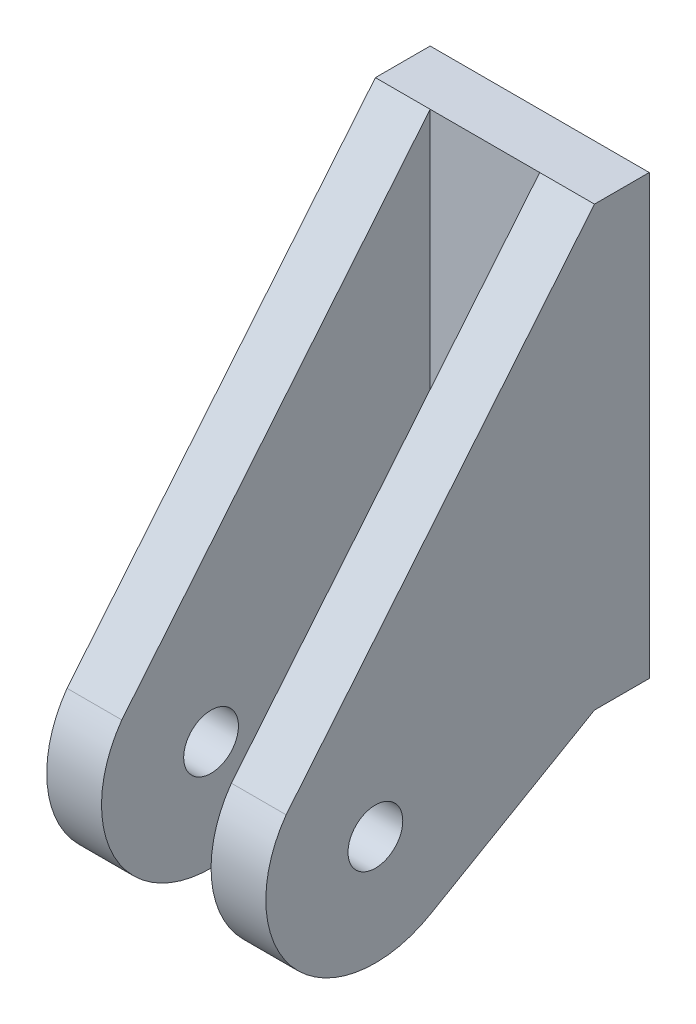
ISO-10303-21;
HEADER;
FILE_DESCRIPTION(('STEP AP214'),'2;1');
FILE_NAME('part.step','',(''),(''),'','','');
FILE_SCHEMA(('AUTOMOTIVE_DESIGN { 1 0 10303 214 1 1 1 1 }'));
ENDSEC;
DATA;
#1=APPLICATION_CONTEXT('core data for automotive mechanical design processes');
#2=APPLICATION_PROTOCOL_DEFINITION('international standard','automotive_design',2000,#1);
#3=PRODUCT_CONTEXT('',#1,'mechanical');
#4=PRODUCT('Part','Part','',(#3));
#5=PRODUCT_RELATED_PRODUCT_CATEGORY('part','',(#4));
#6=PRODUCT_DEFINITION_FORMATION('','',#4);
#7=PRODUCT_DEFINITION_CONTEXT('part definition',#1,'design');
#8=PRODUCT_DEFINITION('design','',#6,#7);
#9=PRODUCT_DEFINITION_SHAPE('','',#8);
#10=(LENGTH_UNIT() NAMED_UNIT(*) SI_UNIT(.MILLI.,.METRE.));
#11=(NAMED_UNIT(*) PLANE_ANGLE_UNIT() SI_UNIT($,.RADIAN.));
#12=(NAMED_UNIT(*) SI_UNIT($,.STERADIAN.) SOLID_ANGLE_UNIT());
#13=UNCERTAINTY_MEASURE_WITH_UNIT(LENGTH_MEASURE(1.E-05),#10,'distance_accuracy_value','');
#14=(GEOMETRIC_REPRESENTATION_CONTEXT(3) GLOBAL_UNCERTAINTY_ASSIGNED_CONTEXT((#13)) GLOBAL_UNIT_ASSIGNED_CONTEXT((#10,
#11,#12)) REPRESENTATION_CONTEXT('',''));
#15=CARTESIAN_POINT('',(0.,0.,0.));
#16=DIRECTION('',(0.,0.,1.));
#17=DIRECTION('',(1.,0.,0.));
#18=AXIS2_PLACEMENT_3D('',#15,#16,#17);
#19=CARTESIAN_POINT('',(0.,0.,6.35));
#20=DIRECTION('',(0.,0.,-1.));
#21=DIRECTION('',(-1.,0.,0.));
#22=AXIS2_PLACEMENT_3D('',#19,#20,#21);
#23=PLANE('',#22);
#24=DIRECTION('',(0.,1.,0.));
#25=VECTOR('',#24,1.);
#26=CARTESIAN_POINT('',(6.35,0.,6.35));
#27=LINE('',#26,#25);
#28=CARTESIAN_POINT('',(6.35,0.,6.35));
#29=VERTEX_POINT('',#28);
#30=CARTESIAN_POINT('',(6.35,50.8,6.35));
#31=VERTEX_POINT('',#30);
#32=EDGE_CURVE('E50',#29,#31,#27,.T.);
#33=ORIENTED_EDGE('',*,*,#32,.F.);
#34=DIRECTION('',(1.,0.,0.));
#35=VECTOR('',#34,1.);
#36=CARTESIAN_POINT('',(0.,0.,6.35));
#37=LINE('',#36,#35);
#38=CARTESIAN_POINT('',(19.05,0.,6.35));
#39=VERTEX_POINT('',#38);
#40=EDGE_CURVE('E191',#29,#39,#37,.T.);
#41=ORIENTED_EDGE('',*,*,#40,.T.);
#42=DIRECTION('',(0.,-1.,0.));
#43=VECTOR('',#42,1.);
#44=CARTESIAN_POINT('',(19.05,0.,6.35));
#45=LINE('',#44,#43);
#46=CARTESIAN_POINT('',(19.05,50.8,6.35));
#47=VERTEX_POINT('',#46);
#48=EDGE_CURVE('E162',#47,#39,#45,.T.);
#49=ORIENTED_EDGE('',*,*,#48,.F.);
#50=DIRECTION('',(-1.,0.,0.));
#51=VECTOR('',#50,1.);
#52=CARTESIAN_POINT('',(0.,50.8,6.35));
#53=LINE('',#52,#51);
#54=EDGE_CURVE('E190',#47,#31,#53,.T.);
#55=ORIENTED_EDGE('',*,*,#54,.T.);
#56=EDGE_LOOP('',(#33,#41,#49,#55));
#57=FACE_BOUND('',#56,.T.);
#58=ADVANCED_FACE('F35',(#57),#23,.F.);
#59=CARTESIAN_POINT('',(0.,0.,6.35));
#60=DIRECTION('',(1.,0.,0.));
#61=DIRECTION('',(0.,0.,-1.));
#62=AXIS2_PLACEMENT_3D('',#59,#60,#61);
#63=PLANE('',#62);
#64=DIRECTION('',(0.,-1.,0.));
#65=VECTOR('',#64,1.);
#66=CARTESIAN_POINT('',(0.,0.,0.));
#67=LINE('',#66,#65);
#68=CARTESIAN_POINT('',(0.,50.8,0.));
#69=VERTEX_POINT('',#68);
#70=CARTESIAN_POINT('',(0.,0.,0.));
#71=VERTEX_POINT('',#70);
#72=EDGE_CURVE('E183',#69,#71,#67,.T.);
#73=ORIENTED_EDGE('',*,*,#72,.T.);
#74=DIRECTION('',(0.,0.,-1.));
#75=VECTOR('',#74,1.);
#76=CARTESIAN_POINT('',(0.,0.,6.35));
#77=LINE('',#76,#75);
#78=CARTESIAN_POINT('',(0.,0.,6.35));
#79=VERTEX_POINT('',#78);
#80=EDGE_CURVE('E11',#79,#71,#77,.T.);
#81=ORIENTED_EDGE('',*,*,#80,.F.);
#82=DIRECTION('',(0.,-0.5,0.866025403784439));
#83=VECTOR('',#82,1.);
#84=CARTESIAN_POINT('',(0.,2.74963065701559,1.5875));
#85=LINE('',#84,#83);
#86=CARTESIAN_POINT('',(0.,-10.9985226280624,25.4));
#87=VERTEX_POINT('',#86);
#88=EDGE_CURVE('E147',#79,#87,#85,.T.);
#89=ORIENTED_EDGE('',*,*,#88,.T.);
#90=CARTESIAN_POINT('',(0.,0.,31.75));
#91=DIRECTION('',(-1.,0.,0.));
#92=DIRECTION('',(0.,0.,1.));
#93=AXIS2_PLACEMENT_3D('',#90,#91,#92);
#94=CIRCLE('',#93,12.7);
#95=CARTESIAN_POINT('',(0.,7.36346033639174,42.0974369712691));
#96=VERTEX_POINT('',#95);
#97=EDGE_CURVE('E118',#87,#96,#94,.T.);
#98=ORIENTED_EDGE('',*,*,#97,.T.);
#99=DIRECTION('',(0.,0.772138076396908,-0.6354547906642));
#100=VECTOR('',#99,1.);
#101=CARTESIAN_POINT('',(0.,23.6288654137857,28.7113213340825));
#102=LINE('',#101,#100);
#103=CARTESIAN_POINT('',(0.,50.8,6.35));
#104=VERTEX_POINT('',#103);
#105=EDGE_CURVE('E139',#96,#104,#102,.T.);
#106=ORIENTED_EDGE('',*,*,#105,.T.);
#107=DIRECTION('',(0.,0.,-1.));
#108=VECTOR('',#107,1.);
#109=CARTESIAN_POINT('',(0.,50.8,6.35));
#110=LINE('',#109,#108);
#111=EDGE_CURVE('E195',#104,#69,#110,.T.);
#112=ORIENTED_EDGE('',*,*,#111,.T.);
#113=EDGE_LOOP('',(#73,#81,#89,#98,#106,#112));
#114=FACE_BOUND('',#113,.T.);
#115=CARTESIAN_POINT('',(0.,0.,31.75));
#116=DIRECTION('',(-1.,0.,0.));
#117=DIRECTION('',(0.,0.,1.));
#118=AXIS2_PLACEMENT_3D('',#115,#116,#117);
#119=CIRCLE('',#118,3.175);
#120=CARTESIAN_POINT('',(0.,0.,34.925));
#121=VERTEX_POINT('',#120);
#122=EDGE_CURVE('E144',#121,#121,#119,.T.);
#123=ORIENTED_EDGE('',*,*,#122,.F.);
#124=EDGE_LOOP('',(#123));
#125=FACE_BOUND('',#124,.T.);
#126=ADVANCED_FACE('F37',(#114,#125),#63,.F.);
#127=CARTESIAN_POINT('',(0.,0.,6.35));
#128=DIRECTION('',(0.,1.,0.));
#129=DIRECTION('',(0.,0.,1.));
#130=AXIS2_PLACEMENT_3D('',#127,#128,#129);
#131=PLANE('',#130);
#132=DIRECTION('',(1.,0.,0.));
#133=VECTOR('',#132,1.);
#134=CARTESIAN_POINT('',(0.,0.,0.));
#135=LINE('',#134,#133);
#136=CARTESIAN_POINT('',(25.4,0.,0.));
#137=VERTEX_POINT('',#136);
#138=EDGE_CURVE('E198',#71,#137,#135,.T.);
#139=ORIENTED_EDGE('',*,*,#138,.T.);
#140=DIRECTION('',(0.,0.,-1.));
#141=VECTOR('',#140,1.);
#142=CARTESIAN_POINT('',(25.4,0.,6.35));
#143=LINE('',#142,#141);
#144=CARTESIAN_POINT('',(25.4,0.,6.35));
#145=VERTEX_POINT('',#144);
#146=EDGE_CURVE('E43',#145,#137,#143,.T.);
#147=ORIENTED_EDGE('',*,*,#146,.F.);
#148=DIRECTION('',(1.,0.,0.));
#149=VECTOR('',#148,1.);
#150=CARTESIAN_POINT('',(19.05,0.,6.35));
#151=LINE('',#150,#149);
#152=EDGE_CURVE('E170',#39,#145,#151,.T.);
#153=ORIENTED_EDGE('',*,*,#152,.F.);
#154=ORIENTED_EDGE('',*,*,#40,.F.);
#155=EDGE_CURVE('E135',#79,#29,#37,.T.);
#156=ORIENTED_EDGE('',*,*,#155,.F.);
#157=ORIENTED_EDGE('',*,*,#80,.T.);
#158=EDGE_LOOP('',(#139,#147,#153,#154,#156,#157));
#159=FACE_BOUND('',#158,.T.);
#160=ADVANCED_FACE('F246',(#159),#131,.F.);
#161=CARTESIAN_POINT('',(25.4,0.,6.35));
#162=DIRECTION('',(-1.,0.,0.));
#163=DIRECTION('',(0.,0.,1.));
#164=AXIS2_PLACEMENT_3D('',#161,#162,#163);
#165=PLANE('',#164);
#166=DIRECTION('',(0.,1.,0.));
#167=VECTOR('',#166,1.);
#168=CARTESIAN_POINT('',(25.4,0.,0.));
#169=LINE('',#168,#167);
#170=CARTESIAN_POINT('',(25.4,50.8,0.));
#171=VERTEX_POINT('',#170);
#172=EDGE_CURVE('E200',#137,#171,#169,.T.);
#173=ORIENTED_EDGE('',*,*,#172,.T.);
#174=DIRECTION('',(0.,0.,-1.));
#175=VECTOR('',#174,1.);
#176=CARTESIAN_POINT('',(25.4,50.8,6.35));
#177=LINE('',#176,#175);
#178=CARTESIAN_POINT('',(25.4,50.8,6.35));
#179=VERTEX_POINT('',#178);
#180=EDGE_CURVE('E206',#179,#171,#177,.T.);
#181=ORIENTED_EDGE('',*,*,#180,.F.);
#182=DIRECTION('',(0.,0.772138076396908,-0.6354547906642));
#183=VECTOR('',#182,1.);
#184=CARTESIAN_POINT('',(25.4,23.6288654137857,28.7113213340825));
#185=LINE('',#184,#183);
#186=CARTESIAN_POINT('',(25.4,7.36346033639175,42.0974369712691));
#187=VERTEX_POINT('',#186);
#188=EDGE_CURVE('E176',#187,#179,#185,.T.);
#189=ORIENTED_EDGE('',*,*,#188,.F.);
#190=CARTESIAN_POINT('',(25.4,0.,31.75));
#191=DIRECTION('',(1.,0.,0.));
#192=DIRECTION('',(0.,0.,-1.));
#193=AXIS2_PLACEMENT_3D('',#190,#191,#192);
#194=CIRCLE('',#193,12.7);
#195=CARTESIAN_POINT('',(25.4,-10.9985226280624,25.4));
#196=VERTEX_POINT('',#195);
#197=EDGE_CURVE('E159',#196,#187,#194,.F.);
#198=ORIENTED_EDGE('',*,*,#197,.F.);
#199=DIRECTION('',(0.,-0.5,0.866025403784439));
#200=VECTOR('',#199,1.);
#201=CARTESIAN_POINT('',(25.4,2.74963065701559,1.5875));
#202=LINE('',#201,#200);
#203=EDGE_CURVE('E173',#145,#196,#202,.T.);
#204=ORIENTED_EDGE('',*,*,#203,.F.);
#205=ORIENTED_EDGE('',*,*,#146,.T.);
#206=EDGE_LOOP('',(#173,#181,#189,#198,#204,#205));
#207=FACE_BOUND('',#206,.T.);
#208=CARTESIAN_POINT('',(25.4,0.,31.75));
#209=DIRECTION('',(1.,0.,0.));
#210=DIRECTION('',(0.,0.,-1.));
#211=AXIS2_PLACEMENT_3D('',#208,#209,#210);
#212=CIRCLE('',#211,3.175);
#213=CARTESIAN_POINT('',(25.4,0.,28.575));
#214=VERTEX_POINT('',#213);
#215=EDGE_CURVE('E153',#214,#214,#212,.T.);
#216=ORIENTED_EDGE('',*,*,#215,.F.);
#217=EDGE_LOOP('',(#216));
#218=FACE_BOUND('',#217,.T.);
#219=ADVANCED_FACE('F212',(#207,#218),#165,.F.);
#220=CARTESIAN_POINT('',(0.,50.8,6.35));
#221=DIRECTION('',(0.,-1.,0.));
#222=DIRECTION('',(0.,0.,-1.));
#223=AXIS2_PLACEMENT_3D('',#220,#221,#222);
#224=PLANE('',#223);
#225=DIRECTION('',(-1.,0.,0.));
#226=VECTOR('',#225,1.);
#227=CARTESIAN_POINT('',(0.,50.8,0.));
#228=LINE('',#227,#226);
#229=EDGE_CURVE('E202',#171,#69,#228,.T.);
#230=ORIENTED_EDGE('',*,*,#229,.T.);
#231=ORIENTED_EDGE('',*,*,#111,.F.);
#232=DIRECTION('',(-1.,0.,0.));
#233=VECTOR('',#232,1.);
#234=CARTESIAN_POINT('',(6.35,50.8,6.35));
#235=LINE('',#234,#233);
#236=EDGE_CURVE('E58',#31,#104,#235,.T.);
#237=ORIENTED_EDGE('',*,*,#236,.F.);
#238=ORIENTED_EDGE('',*,*,#54,.F.);
#239=EDGE_CURVE('E192',#179,#47,#53,.T.);
#240=ORIENTED_EDGE('',*,*,#239,.F.);
#241=ORIENTED_EDGE('',*,*,#180,.T.);
#242=EDGE_LOOP('',(#230,#231,#237,#238,#240,#241));
#243=FACE_BOUND('',#242,.T.);
#244=ADVANCED_FACE('F220',(#243),#224,.F.);
#245=CARTESIAN_POINT('',(0.,0.,0.));
#246=DIRECTION('',(0.,0.,-1.));
#247=DIRECTION('',(-1.,0.,0.));
#248=AXIS2_PLACEMENT_3D('',#245,#246,#247);
#249=PLANE('',#248);
#250=ORIENTED_EDGE('',*,*,#72,.F.);
#251=ORIENTED_EDGE('',*,*,#229,.F.);
#252=ORIENTED_EDGE('',*,*,#172,.F.);
#253=ORIENTED_EDGE('',*,*,#138,.F.);
#254=EDGE_LOOP('',(#250,#251,#252,#253));
#255=FACE_BOUND('',#254,.T.);
#256=ADVANCED_FACE('F219',(#255),#249,.T.);
#257=CARTESIAN_POINT('',(19.05,2.74963065701559,1.5875));
#258=DIRECTION('',(0.,0.866025403784439,0.5));
#259=DIRECTION('',(0.,-0.5,0.866025403784439));
#260=AXIS2_PLACEMENT_3D('',#257,#258,#259);
#261=PLANE('',#260);
#262=ORIENTED_EDGE('',*,*,#203,.T.);
#263=DIRECTION('',(1.,0.,0.));
#264=VECTOR('',#263,1.);
#265=CARTESIAN_POINT('',(19.05,-10.9985226280624,25.4));
#266=LINE('',#265,#264);
#267=CARTESIAN_POINT('',(19.05,-10.9985226280624,25.4));
#268=VERTEX_POINT('',#267);
#269=EDGE_CURVE('E180',#268,#196,#266,.T.);
#270=ORIENTED_EDGE('',*,*,#269,.F.);
#271=DIRECTION('',(0.,-0.5,0.866025403784439));
#272=VECTOR('',#271,1.);
#273=CARTESIAN_POINT('',(19.05,2.74963065701559,1.5875));
#274=LINE('',#273,#272);
#275=EDGE_CURVE('E158',#39,#268,#274,.T.);
#276=ORIENTED_EDGE('',*,*,#275,.F.);
#277=ORIENTED_EDGE('',*,*,#152,.T.);
#278=EDGE_LOOP('',(#262,#270,#276,#277));
#279=FACE_BOUND('',#278,.T.);
#280=ADVANCED_FACE('F253',(#279),#261,.F.);
#281=CARTESIAN_POINT('',(19.05,0.,31.75));
#282=DIRECTION('',(1.,0.,0.));
#283=DIRECTION('',(0.,0.,-1.));
#284=AXIS2_PLACEMENT_3D('',#281,#282,#283);
#285=CYLINDRICAL_SURFACE('',#284,12.7);
#286=ORIENTED_EDGE('',*,*,#197,.T.);
#287=DIRECTION('',(1.,0.,0.));
#288=VECTOR('',#287,1.);
#289=CARTESIAN_POINT('',(19.05,7.36346033639175,42.0974369712691));
#290=LINE('',#289,#288);
#291=CARTESIAN_POINT('',(19.05,7.36346033639175,42.0974369712691));
#292=VERTEX_POINT('',#291);
#293=EDGE_CURVE('E184',#292,#187,#290,.T.);
#294=ORIENTED_EDGE('',*,*,#293,.F.);
#295=CARTESIAN_POINT('',(19.05,0.,31.75));
#296=DIRECTION('',(1.,0.,0.));
#297=DIRECTION('',(0.,0.,-1.));
#298=AXIS2_PLACEMENT_3D('',#295,#296,#297);
#299=CIRCLE('',#298,12.7);
#300=EDGE_CURVE('E168',#268,#292,#299,.F.);
#301=ORIENTED_EDGE('',*,*,#300,.F.);
#302=ORIENTED_EDGE('',*,*,#269,.T.);
#303=EDGE_LOOP('',(#286,#294,#301,#302));
#304=FACE_BOUND('',#303,.T.);
#305=ADVANCED_FACE('F269',(#304),#285,.T.);
#306=CARTESIAN_POINT('',(19.05,23.6288654137857,28.7113213340825));
#307=DIRECTION('',(0.,-0.6354547906642,-0.772138076396908));
#308=DIRECTION('',(0.,0.772138076396908,-0.6354547906642));
#309=AXIS2_PLACEMENT_3D('',#306,#307,#308);
#310=PLANE('',#309);
#311=ORIENTED_EDGE('',*,*,#188,.T.);
#312=ORIENTED_EDGE('',*,*,#239,.T.);
#313=DIRECTION('',(0.,0.772138076396908,-0.6354547906642));
#314=VECTOR('',#313,1.);
#315=CARTESIAN_POINT('',(19.05,23.6288654137857,28.7113213340825));
#316=LINE('',#315,#314);
#317=EDGE_CURVE('E165',#292,#47,#316,.T.);
#318=ORIENTED_EDGE('',*,*,#317,.F.);
#319=ORIENTED_EDGE('',*,*,#293,.T.);
#320=EDGE_LOOP('',(#311,#312,#318,#319));
#321=FACE_BOUND('',#320,.T.);
#322=ADVANCED_FACE('F265',(#321),#310,.F.);
#323=CARTESIAN_POINT('',(19.05,0.,31.75));
#324=DIRECTION('',(1.,0.,0.));
#325=DIRECTION('',(0.,0.,-1.));
#326=AXIS2_PLACEMENT_3D('',#323,#324,#325);
#327=CYLINDRICAL_SURFACE('',#326,3.175);
#328=CARTESIAN_POINT('',(19.05,0.,31.75));
#329=DIRECTION('',(1.,0.,0.));
#330=DIRECTION('',(0.,0.,-1.));
#331=AXIS2_PLACEMENT_3D('',#328,#329,#330);
#332=CIRCLE('',#331,3.175);
#333=CARTESIAN_POINT('',(19.05,0.,28.575));
#334=VERTEX_POINT('',#333);
#335=EDGE_CURVE('E155',#334,#334,#332,.T.);
#336=ORIENTED_EDGE('',*,*,#335,.F.);
#337=EDGE_LOOP('',(#336));
#338=FACE_BOUND('',#337,.T.);
#339=ORIENTED_EDGE('',*,*,#215,.T.);
#340=EDGE_LOOP('',(#339));
#341=FACE_BOUND('',#340,.T.);
#342=ADVANCED_FACE('F249',(#338,#341),#327,.F.);
#343=CARTESIAN_POINT('',(19.05,0.,0.));
#344=DIRECTION('',(1.,0.,0.));
#345=DIRECTION('',(0.,0.,-1.));
#346=AXIS2_PLACEMENT_3D('',#343,#344,#345);
#347=PLANE('',#346);
#348=ORIENTED_EDGE('',*,*,#335,.T.);
#349=EDGE_LOOP('',(#348));
#350=FACE_BOUND('',#349,.T.);
#351=ORIENTED_EDGE('',*,*,#275,.T.);
#352=ORIENTED_EDGE('',*,*,#300,.T.);
#353=ORIENTED_EDGE('',*,*,#317,.T.);
#354=ORIENTED_EDGE('',*,*,#48,.T.);
#355=EDGE_LOOP('',(#351,#352,#353,#354));
#356=FACE_BOUND('',#355,.T.);
#357=ADVANCED_FACE('F237',(#350,#356),#347,.F.);
#358=CARTESIAN_POINT('',(6.35,2.74963065701559,1.5875));
#359=DIRECTION('',(0.,-0.866025403784439,-0.5));
#360=DIRECTION('',(0.,0.5,-0.866025403784439));
#361=AXIS2_PLACEMENT_3D('',#358,#359,#360);
#362=PLANE('',#361);
#363=ORIENTED_EDGE('',*,*,#88,.F.);
#364=ORIENTED_EDGE('',*,*,#155,.T.);
#365=DIRECTION('',(0.,-0.5,0.866025403784439));
#366=VECTOR('',#365,1.);
#367=CARTESIAN_POINT('',(6.35,2.74963065701559,1.5875));
#368=LINE('',#367,#366);
#369=CARTESIAN_POINT('',(6.35,-10.9985226280624,25.4));
#370=VERTEX_POINT('',#369);
#371=EDGE_CURVE('E129',#29,#370,#368,.T.);
#372=ORIENTED_EDGE('',*,*,#371,.T.);
#373=DIRECTION('',(-1.,0.,0.));
#374=VECTOR('',#373,1.);
#375=CARTESIAN_POINT('',(6.35,-10.9985226280624,25.4));
#376=LINE('',#375,#374);
#377=EDGE_CURVE('E113',#370,#87,#376,.T.);
#378=ORIENTED_EDGE('',*,*,#377,.T.);
#379=EDGE_LOOP('',(#363,#364,#372,#378));
#380=FACE_BOUND('',#379,.T.);
#381=ADVANCED_FACE('F134',(#380),#362,.T.);
#382=CARTESIAN_POINT('',(6.35,23.6288654137857,28.7113213340825));
#383=DIRECTION('',(0.,0.6354547906642,0.772138076396908));
#384=DIRECTION('',(0.,-0.772138076396908,0.6354547906642));
#385=AXIS2_PLACEMENT_3D('',#382,#383,#384);
#386=PLANE('',#385);
#387=ORIENTED_EDGE('',*,*,#105,.F.);
#388=DIRECTION('',(-1.,0.,0.));
#389=VECTOR('',#388,1.);
#390=CARTESIAN_POINT('',(6.35,7.36346033639174,42.0974369712691));
#391=LINE('',#390,#389);
#392=CARTESIAN_POINT('',(6.35,7.36346033639174,42.0974369712691));
#393=VERTEX_POINT('',#392);
#394=EDGE_CURVE('E123',#393,#96,#391,.T.);
#395=ORIENTED_EDGE('',*,*,#394,.F.);
#396=DIRECTION('',(0.,0.772138076396908,-0.6354547906642));
#397=VECTOR('',#396,1.);
#398=CARTESIAN_POINT('',(6.35,23.6288654137857,28.7113213340825));
#399=LINE('',#398,#397);
#400=EDGE_CURVE('E131',#393,#31,#399,.T.);
#401=ORIENTED_EDGE('',*,*,#400,.T.);
#402=ORIENTED_EDGE('',*,*,#236,.T.);
#403=EDGE_LOOP('',(#387,#395,#401,#402));
#404=FACE_BOUND('',#403,.T.);
#405=ADVANCED_FACE('F227',(#404),#386,.T.);
#406=CARTESIAN_POINT('',(6.35,0.,31.75));
#407=DIRECTION('',(-1.,0.,0.));
#408=DIRECTION('',(0.,0.,1.));
#409=AXIS2_PLACEMENT_3D('',#406,#407,#408);
#410=CYLINDRICAL_SURFACE('',#409,3.175);
#411=CARTESIAN_POINT('',(6.35,0.,31.75));
#412=DIRECTION('',(-1.,0.,0.));
#413=DIRECTION('',(0.,0.,1.));
#414=AXIS2_PLACEMENT_3D('',#411,#412,#413);
#415=CIRCLE('',#414,3.175);
#416=CARTESIAN_POINT('',(6.35,0.,34.925));
#417=VERTEX_POINT('',#416);
#418=EDGE_CURVE('E136',#417,#417,#415,.T.);
#419=ORIENTED_EDGE('',*,*,#418,.F.);
#420=EDGE_LOOP('',(#419));
#421=FACE_BOUND('',#420,.T.);
#422=ORIENTED_EDGE('',*,*,#122,.T.);
#423=EDGE_LOOP('',(#422));
#424=FACE_BOUND('',#423,.T.);
#425=ADVANCED_FACE('F229',(#421,#424),#410,.F.);
#426=CARTESIAN_POINT('',(6.35,0.,31.75));
#427=DIRECTION('',(-1.,0.,0.));
#428=DIRECTION('',(0.,0.,1.));
#429=AXIS2_PLACEMENT_3D('',#426,#427,#428);
#430=CYLINDRICAL_SURFACE('',#429,12.7);
#431=ORIENTED_EDGE('',*,*,#97,.F.);
#432=ORIENTED_EDGE('',*,*,#377,.F.);
#433=CARTESIAN_POINT('',(6.35,0.,31.75));
#434=DIRECTION('',(-1.,0.,0.));
#435=DIRECTION('',(0.,0.,1.));
#436=AXIS2_PLACEMENT_3D('',#433,#434,#435);
#437=CIRCLE('',#436,12.7);
#438=EDGE_CURVE('E116',#370,#393,#437,.T.);
#439=ORIENTED_EDGE('',*,*,#438,.T.);
#440=ORIENTED_EDGE('',*,*,#394,.T.);
#441=EDGE_LOOP('',(#431,#432,#439,#440));
#442=FACE_BOUND('',#441,.T.);
#443=ADVANCED_FACE('F115',(#442),#430,.T.);
#444=CARTESIAN_POINT('',(6.35,0.,0.));
#445=DIRECTION('',(-1.,0.,0.));
#446=DIRECTION('',(0.,0.,1.));
#447=AXIS2_PLACEMENT_3D('',#444,#445,#446);
#448=PLANE('',#447);
#449=ORIENTED_EDGE('',*,*,#418,.T.);
#450=EDGE_LOOP('',(#449));
#451=FACE_BOUND('',#450,.T.);
#452=ORIENTED_EDGE('',*,*,#371,.F.);
#453=ORIENTED_EDGE('',*,*,#32,.T.);
#454=ORIENTED_EDGE('',*,*,#400,.F.);
#455=ORIENTED_EDGE('',*,*,#438,.F.);
#456=EDGE_LOOP('',(#452,#453,#454,#455));
#457=FACE_BOUND('',#456,.T.);
#458=ADVANCED_FACE('F128',(#451,#457),#448,.F.);
#459=CLOSED_SHELL('',(#58,#126,#160,#219,#244,#256,#280,#305,#322,#342,#357,#381,#405,#425,#443,#458));
#460=MANIFOLD_SOLID_BREP('B2',#459);
#461=ADVANCED_BREP_SHAPE_REPRESENTATION('',(#18,#460),#14);
#462=SHAPE_DEFINITION_REPRESENTATION(#9,#461);
ENDSEC;
END-ISO-10303-21;
